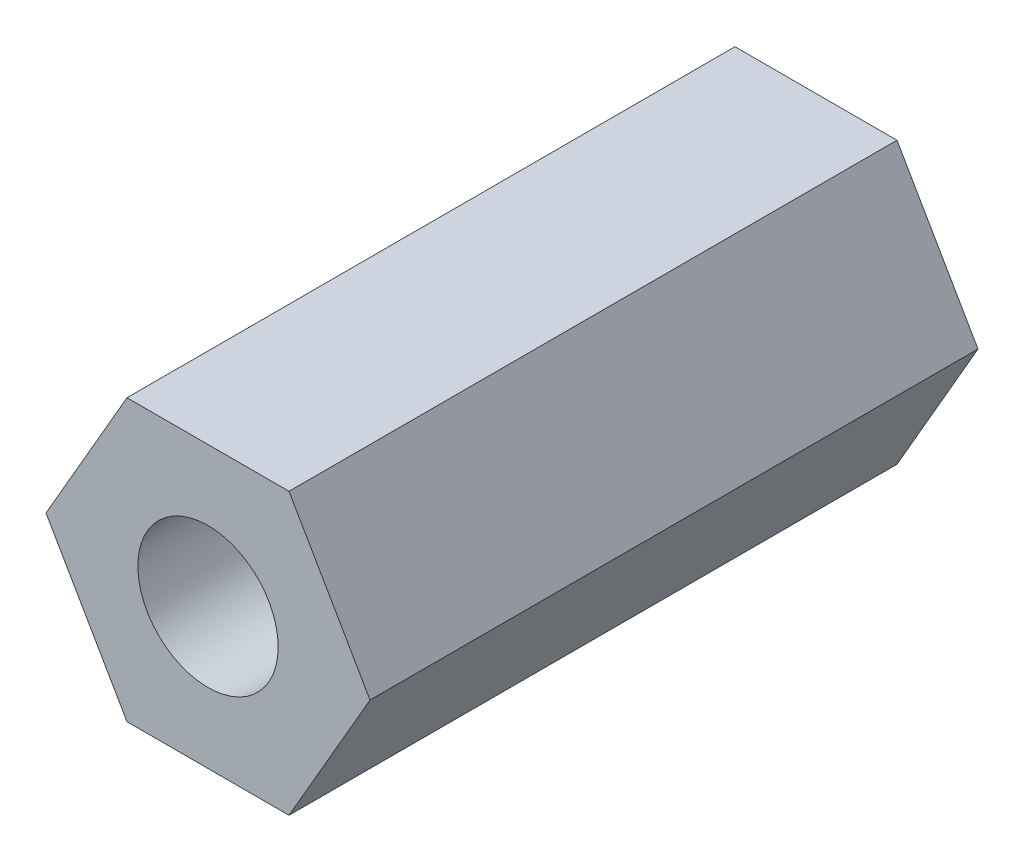
ISO-10303-21;
HEADER;
FILE_DESCRIPTION(('STEP AP214'),'2;1');
FILE_NAME('part.step','',(''),(''),'','','');
FILE_SCHEMA(('AUTOMOTIVE_DESIGN { 1 0 10303 214 1 1 1 1 }'));
ENDSEC;
DATA;
#1=APPLICATION_CONTEXT('core data for automotive mechanical design processes');
#2=APPLICATION_PROTOCOL_DEFINITION('international standard','automotive_design',2000,#1);
#3=PRODUCT_CONTEXT('',#1,'mechanical');
#4=PRODUCT('Part','Part','',(#3));
#5=PRODUCT_RELATED_PRODUCT_CATEGORY('part','',(#4));
#6=PRODUCT_DEFINITION_FORMATION('','',#4);
#7=PRODUCT_DEFINITION_CONTEXT('part definition',#1,'design');
#8=PRODUCT_DEFINITION('design','',#6,#7);
#9=PRODUCT_DEFINITION_SHAPE('','',#8);
#10=(LENGTH_UNIT() NAMED_UNIT(*) SI_UNIT(.MILLI.,.METRE.));
#11=(NAMED_UNIT(*) PLANE_ANGLE_UNIT() SI_UNIT($,.RADIAN.));
#12=(NAMED_UNIT(*) SI_UNIT($,.STERADIAN.) SOLID_ANGLE_UNIT());
#13=UNCERTAINTY_MEASURE_WITH_UNIT(LENGTH_MEASURE(1.E-05),#10,'distance_accuracy_value','');
#14=(GEOMETRIC_REPRESENTATION_CONTEXT(3) GLOBAL_UNCERTAINTY_ASSIGNED_CONTEXT((#13)) GLOBAL_UNIT_ASSIGNED_CONTEXT((#10,
#11,#12)) REPRESENTATION_CONTEXT('',''));
#15=CARTESIAN_POINT('',(0.,0.,0.));
#16=DIRECTION('',(0.,0.,1.));
#17=DIRECTION('',(1.,0.,0.));
#18=AXIS2_PLACEMENT_3D('',#15,#16,#17);
#19=CARTESIAN_POINT('',(-1.73205080756888,-3.,13.));
#20=DIRECTION('',(0.866025403784439,-0.5,0.));
#21=DIRECTION('',(0.5,0.866025403784439,0.));
#22=AXIS2_PLACEMENT_3D('',#19,#20,#21);
#23=PLANE('',#22);
#24=DIRECTION('',(0.,0.,1.));
#25=VECTOR('',#24,1.);
#26=CARTESIAN_POINT('',(-1.73205080756888,-3.,13.));
#27=LINE('',#26,#25);
#28=CARTESIAN_POINT('',(-1.73205080756888,-3.,0.));
#29=VERTEX_POINT('',#28);
#30=CARTESIAN_POINT('',(-1.73205080756888,-3.,13.));
#31=VERTEX_POINT('',#30);
#32=EDGE_CURVE('E96',#29,#31,#27,.T.);
#33=ORIENTED_EDGE('',*,*,#32,.T.);
#34=DIRECTION('',(0.500000000000001,0.866025403784438,0.));
#35=VECTOR('',#34,1.);
#36=CARTESIAN_POINT('',(-1.73205080756888,-3.,13.));
#37=LINE('',#36,#35);
#38=CARTESIAN_POINT('',(0.,0.,13.));
#39=VERTEX_POINT('',#38);
#40=EDGE_CURVE('E108',#31,#39,#37,.T.);
#41=ORIENTED_EDGE('',*,*,#40,.T.);
#42=DIRECTION('',(0.,0.,1.));
#43=VECTOR('',#42,1.);
#44=CARTESIAN_POINT('',(0.,0.,13.));
#45=LINE('',#44,#43);
#46=CARTESIAN_POINT('',(0.,0.,0.));
#47=VERTEX_POINT('',#46);
#48=EDGE_CURVE('E66',#39,#47,#45,.F.);
#49=ORIENTED_EDGE('',*,*,#48,.T.);
#50=DIRECTION('',(0.500000000000001,0.866025403784438,0.));
#51=VECTOR('',#50,1.);
#52=CARTESIAN_POINT('',(-1.73205080756888,-3.,0.));
#53=LINE('',#52,#51);
#54=EDGE_CURVE('E107',#29,#47,#53,.T.);
#55=ORIENTED_EDGE('',*,*,#54,.F.);
#56=EDGE_LOOP('',(#33,#41,#49,#55));
#57=FACE_BOUND('',#56,.T.);
#58=ADVANCED_FACE('F17',(#57),#23,.F.);
#59=CARTESIAN_POINT('',(0.,0.,13.));
#60=DIRECTION('',(0.,-1.,0.));
#61=DIRECTION('',(1.,0.,0.));
#62=AXIS2_PLACEMENT_3D('',#59,#60,#61);
#63=PLANE('',#62);
#64=ORIENTED_EDGE('',*,*,#48,.F.);
#65=DIRECTION('',(-1.,0.,0.));
#66=VECTOR('',#65,1.);
#67=CARTESIAN_POINT('',(0.,0.,13.));
#68=LINE('',#67,#66);
#69=CARTESIAN_POINT('',(3.46410161513775,0.,13.));
#70=VERTEX_POINT('',#69);
#71=EDGE_CURVE('E87',#39,#70,#68,.F.);
#72=ORIENTED_EDGE('',*,*,#71,.T.);
#73=DIRECTION('',(0.,0.,1.));
#74=VECTOR('',#73,1.);
#75=CARTESIAN_POINT('',(3.46410161513775,0.,13.));
#76=LINE('',#75,#74);
#77=CARTESIAN_POINT('',(3.46410161513775,0.,0.));
#78=VERTEX_POINT('',#77);
#79=EDGE_CURVE('E73',#70,#78,#76,.F.);
#80=ORIENTED_EDGE('',*,*,#79,.T.);
#81=DIRECTION('',(-1.,0.,0.));
#82=VECTOR('',#81,1.);
#83=CARTESIAN_POINT('',(0.,0.,0.));
#84=LINE('',#83,#82);
#85=EDGE_CURVE('E109',#47,#78,#84,.F.);
#86=ORIENTED_EDGE('',*,*,#85,.F.);
#87=EDGE_LOOP('',(#64,#72,#80,#86));
#88=FACE_BOUND('',#87,.T.);
#89=ADVANCED_FACE('F93',(#88),#63,.F.);
#90=CARTESIAN_POINT('',(3.46410161513775,0.,13.));
#91=DIRECTION('',(-0.866025403784439,-0.5,0.));
#92=DIRECTION('',(0.5,-0.866025403784439,0.));
#93=AXIS2_PLACEMENT_3D('',#90,#91,#92);
#94=PLANE('',#93);
#95=ORIENTED_EDGE('',*,*,#79,.F.);
#96=DIRECTION('',(0.5,-0.866025403784439,0.));
#97=VECTOR('',#96,1.);
#98=CARTESIAN_POINT('',(3.46410161513775,0.,13.));
#99=LINE('',#98,#97);
#100=CARTESIAN_POINT('',(5.19615242270663,-3.,13.));
#101=VERTEX_POINT('',#100);
#102=EDGE_CURVE('E77',#70,#101,#99,.T.);
#103=ORIENTED_EDGE('',*,*,#102,.T.);
#104=DIRECTION('',(0.,0.,1.));
#105=VECTOR('',#104,1.);
#106=CARTESIAN_POINT('',(5.19615242270663,-3.,13.));
#107=LINE('',#106,#105);
#108=CARTESIAN_POINT('',(5.19615242270663,-3.,0.));
#109=VERTEX_POINT('',#108);
#110=EDGE_CURVE('E79',#101,#109,#107,.F.);
#111=ORIENTED_EDGE('',*,*,#110,.T.);
#112=DIRECTION('',(0.5,-0.866025403784439,0.));
#113=VECTOR('',#112,1.);
#114=CARTESIAN_POINT('',(3.46410161513775,0.,0.));
#115=LINE('',#114,#113);
#116=EDGE_CURVE('E78',#78,#109,#115,.T.);
#117=ORIENTED_EDGE('',*,*,#116,.F.);
#118=EDGE_LOOP('',(#95,#103,#111,#117));
#119=FACE_BOUND('',#118,.T.);
#120=ADVANCED_FACE('F75',(#119),#94,.F.);
#121=CARTESIAN_POINT('',(5.19615242270663,-3.,13.));
#122=DIRECTION('',(-0.866025403784439,0.5,0.));
#123=DIRECTION('',(-0.5,-0.866025403784439,0.));
#124=AXIS2_PLACEMENT_3D('',#121,#122,#123);
#125=PLANE('',#124);
#126=ORIENTED_EDGE('',*,*,#110,.F.);
#127=DIRECTION('',(-0.5,-0.866025403784439,0.));
#128=VECTOR('',#127,1.);
#129=CARTESIAN_POINT('',(5.19615242270663,-3.,13.));
#130=LINE('',#129,#128);
#131=CARTESIAN_POINT('',(3.46410161513775,-6.,13.));
#132=VERTEX_POINT('',#131);
#133=EDGE_CURVE('E91',#101,#132,#130,.T.);
#134=ORIENTED_EDGE('',*,*,#133,.T.);
#135=DIRECTION('',(0.,0.,1.));
#136=VECTOR('',#135,1.);
#137=CARTESIAN_POINT('',(3.46410161513775,-6.,13.));
#138=LINE('',#137,#136);
#139=CARTESIAN_POINT('',(3.46410161513775,-6.,0.));
#140=VERTEX_POINT('',#139);
#141=EDGE_CURVE('E101',#132,#140,#138,.F.);
#142=ORIENTED_EDGE('',*,*,#141,.T.);
#143=DIRECTION('',(-0.5,-0.866025403784439,0.));
#144=VECTOR('',#143,1.);
#145=CARTESIAN_POINT('',(5.19615242270663,-3.,0.));
#146=LINE('',#145,#144);
#147=EDGE_CURVE('E111',#109,#140,#146,.T.);
#148=ORIENTED_EDGE('',*,*,#147,.F.);
#149=EDGE_LOOP('',(#126,#134,#142,#148));
#150=FACE_BOUND('',#149,.T.);
#151=ADVANCED_FACE('F123',(#150),#125,.F.);
#152=CARTESIAN_POINT('',(3.46410161513775,-6.,13.));
#153=DIRECTION('',(0.,1.,0.));
#154=DIRECTION('',(0.,0.,1.));
#155=AXIS2_PLACEMENT_3D('',#152,#153,#154);
#156=PLANE('',#155);
#157=ORIENTED_EDGE('',*,*,#141,.F.);
#158=DIRECTION('',(-1.,0.,0.));
#159=VECTOR('',#158,1.);
#160=CARTESIAN_POINT('',(0.,-6.,13.));
#161=LINE('',#160,#159);
#162=CARTESIAN_POINT('',(0.,-6.,13.));
#163=VERTEX_POINT('',#162);
#164=EDGE_CURVE('E120',#132,#163,#161,.T.);
#165=ORIENTED_EDGE('',*,*,#164,.T.);
#166=DIRECTION('',(0.,0.,1.));
#167=VECTOR('',#166,1.);
#168=CARTESIAN_POINT('',(0.,-6.,13.));
#169=LINE('',#168,#167);
#170=CARTESIAN_POINT('',(0.,-6.,0.));
#171=VERTEX_POINT('',#170);
#172=EDGE_CURVE('E94',#163,#171,#169,.F.);
#173=ORIENTED_EDGE('',*,*,#172,.T.);
#174=DIRECTION('',(-1.,0.,0.));
#175=VECTOR('',#174,1.);
#176=CARTESIAN_POINT('',(0.,-6.,0.));
#177=LINE('',#176,#175);
#178=EDGE_CURVE('E33',#140,#171,#177,.T.);
#179=ORIENTED_EDGE('',*,*,#178,.F.);
#180=EDGE_LOOP('',(#157,#165,#173,#179));
#181=FACE_BOUND('',#180,.T.);
#182=ADVANCED_FACE('F149',(#181),#156,.F.);
#183=CARTESIAN_POINT('',(0.,-6.,13.));
#184=DIRECTION('',(0.866025403784439,0.5,0.));
#185=DIRECTION('',(-0.5,0.866025403784439,0.));
#186=AXIS2_PLACEMENT_3D('',#183,#184,#185);
#187=PLANE('',#186);
#188=ORIENTED_EDGE('',*,*,#172,.F.);
#189=DIRECTION('',(-0.5,0.866025403784438,0.));
#190=VECTOR('',#189,1.);
#191=CARTESIAN_POINT('',(0.,-6.,13.));
#192=LINE('',#191,#190);
#193=EDGE_CURVE('E117',#163,#31,#192,.T.);
#194=ORIENTED_EDGE('',*,*,#193,.T.);
#195=ORIENTED_EDGE('',*,*,#32,.F.);
#196=DIRECTION('',(-0.5,0.866025403784438,0.));
#197=VECTOR('',#196,1.);
#198=CARTESIAN_POINT('',(0.,-6.,0.));
#199=LINE('',#198,#197);
#200=EDGE_CURVE('E125',#171,#29,#199,.T.);
#201=ORIENTED_EDGE('',*,*,#200,.F.);
#202=EDGE_LOOP('',(#188,#194,#195,#201));
#203=FACE_BOUND('',#202,.T.);
#204=ADVANCED_FACE('F146',(#203),#187,.F.);
#205=CARTESIAN_POINT('',(0.,0.,13.));
#206=DIRECTION('',(0.,0.,-1.));
#207=DIRECTION('',(-1.,0.,0.));
#208=AXIS2_PLACEMENT_3D('',#205,#206,#207);
#209=PLANE('',#208);
#210=ORIENTED_EDGE('',*,*,#193,.F.);
#211=ORIENTED_EDGE('',*,*,#164,.F.);
#212=ORIENTED_EDGE('',*,*,#133,.F.);
#213=ORIENTED_EDGE('',*,*,#102,.F.);
#214=ORIENTED_EDGE('',*,*,#71,.F.);
#215=ORIENTED_EDGE('',*,*,#40,.F.);
#216=EDGE_LOOP('',(#210,#211,#212,#213,#214,#215));
#217=FACE_BOUND('',#216,.T.);
#218=CARTESIAN_POINT('',(1.73205080756887,-3.,13.));
#219=DIRECTION('',(0.,0.,1.));
#220=DIRECTION('',(1.,0.,0.));
#221=AXIS2_PLACEMENT_3D('',#218,#219,#220);
#222=CIRCLE('',#221,1.5);
#223=CARTESIAN_POINT('',(3.23205080756887,-3.,13.));
#224=VERTEX_POINT('',#223);
#225=EDGE_CURVE('E20',#224,#224,#222,.F.);
#226=ORIENTED_EDGE('',*,*,#225,.T.);
#227=EDGE_LOOP('',(#226));
#228=FACE_BOUND('',#227,.T.);
#229=ADVANCED_FACE('F84',(#217,#228),#209,.F.);
#230=CARTESIAN_POINT('',(0.,0.,0.));
#231=DIRECTION('',(0.,0.,-1.));
#232=DIRECTION('',(-1.,0.,0.));
#233=AXIS2_PLACEMENT_3D('',#230,#231,#232);
#234=PLANE('',#233);
#235=ORIENTED_EDGE('',*,*,#178,.T.);
#236=ORIENTED_EDGE('',*,*,#200,.T.);
#237=ORIENTED_EDGE('',*,*,#54,.T.);
#238=ORIENTED_EDGE('',*,*,#85,.T.);
#239=ORIENTED_EDGE('',*,*,#116,.T.);
#240=ORIENTED_EDGE('',*,*,#147,.T.);
#241=EDGE_LOOP('',(#235,#236,#237,#238,#239,#240));
#242=FACE_BOUND('',#241,.T.);
#243=CARTESIAN_POINT('',(1.73205080756887,-3.,0.));
#244=DIRECTION('',(0.,0.,1.));
#245=DIRECTION('',(1.,0.,0.));
#246=AXIS2_PLACEMENT_3D('',#243,#244,#245);
#247=CIRCLE('',#246,1.5);
#248=CARTESIAN_POINT('',(3.23205080756887,-3.,0.));
#249=VERTEX_POINT('',#248);
#250=EDGE_CURVE('E11',#249,#249,#247,.T.);
#251=ORIENTED_EDGE('',*,*,#250,.T.);
#252=EDGE_LOOP('',(#251));
#253=FACE_BOUND('',#252,.T.);
#254=ADVANCED_FACE('F134',(#242,#253),#234,.T.);
#255=CARTESIAN_POINT('',(1.73205080756887,-3.,0.));
#256=DIRECTION('',(0.,0.,1.));
#257=DIRECTION('',(1.,0.,0.));
#258=AXIS2_PLACEMENT_3D('',#255,#256,#257);
#259=CYLINDRICAL_SURFACE('',#258,1.5);
#260=ORIENTED_EDGE('',*,*,#250,.F.);
#261=EDGE_LOOP('',(#260));
#262=FACE_BOUND('',#261,.T.);
#263=ORIENTED_EDGE('',*,*,#225,.F.);
#264=EDGE_LOOP('',(#263));
#265=FACE_BOUND('',#264,.T.);
#266=ADVANCED_FACE('F132',(#262,#265),#259,.F.);
#267=CLOSED_SHELL('',(#58,#89,#120,#151,#182,#204,#229,#254,#266));
#268=MANIFOLD_SOLID_BREP('B1',#267);
#269=ADVANCED_BREP_SHAPE_REPRESENTATION('',(#18,#268),#14);
#270=SHAPE_DEFINITION_REPRESENTATION(#9,#269);
ENDSEC;
END-ISO-10303-21;
